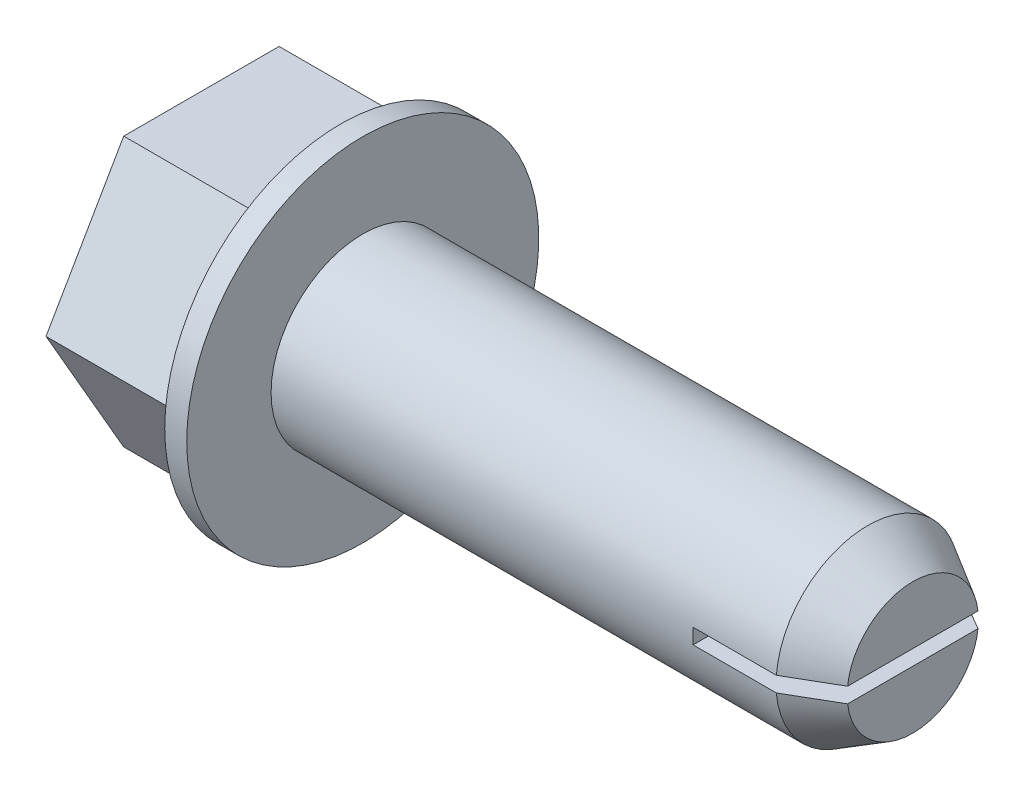
ISO-10303-21;
HEADER;
FILE_DESCRIPTION(('STEP AP214'),'2;1');
FILE_NAME('part.step','',(''),(''),'','','');
FILE_SCHEMA(('AUTOMOTIVE_DESIGN { 1 0 10303 214 1 1 1 1 }'));
ENDSEC;
DATA;
#1=APPLICATION_CONTEXT('core data for automotive mechanical design processes');
#2=APPLICATION_PROTOCOL_DEFINITION('international standard','automotive_design',2000,#1);
#3=PRODUCT_CONTEXT('',#1,'mechanical');
#4=PRODUCT('Part','Part','',(#3));
#5=PRODUCT_RELATED_PRODUCT_CATEGORY('part','',(#4));
#6=PRODUCT_DEFINITION_FORMATION('','',#4);
#7=PRODUCT_DEFINITION_CONTEXT('part definition',#1,'design');
#8=PRODUCT_DEFINITION('design','',#6,#7);
#9=PRODUCT_DEFINITION_SHAPE('','',#8);
#10=(LENGTH_UNIT() NAMED_UNIT(*) SI_UNIT(.MILLI.,.METRE.));
#11=(NAMED_UNIT(*) PLANE_ANGLE_UNIT() SI_UNIT($,.RADIAN.));
#12=(NAMED_UNIT(*) SI_UNIT($,.STERADIAN.) SOLID_ANGLE_UNIT());
#13=UNCERTAINTY_MEASURE_WITH_UNIT(LENGTH_MEASURE(1.E-05),#10,'distance_accuracy_value','');
#14=(GEOMETRIC_REPRESENTATION_CONTEXT(3) GLOBAL_UNCERTAINTY_ASSIGNED_CONTEXT((#13)) GLOBAL_UNIT_ASSIGNED_CONTEXT((#10,
#11,#12)) REPRESENTATION_CONTEXT('',''));
#15=CARTESIAN_POINT('',(0.,0.,0.));
#16=DIRECTION('',(0.,0.,1.));
#17=DIRECTION('',(1.,0.,0.));
#18=AXIS2_PLACEMENT_3D('',#15,#16,#17);
#19=CARTESIAN_POINT('',(17.4882097868151,0.,0.));
#20=DIRECTION('',(-1.,0.,0.));
#21=DIRECTION('',(0.,0.,1.));
#22=AXIS2_PLACEMENT_3D('',#19,#20,#21);
#23=CONICAL_SURFACE('',#22,3.175,0.523598775598292);
#24=CARTESIAN_POINT('',(13.5644644613219,0.264583333333333,-5.43393783266142));
#25=CARTESIAN_POINT('',(14.0871826436278,0.264583333333333,-5.13177479743097));
#26=CARTESIAN_POINT('',(14.6098866976322,0.264583333333333,-4.82958732171453));
#27=CARTESIAN_POINT('',(15.6552095136867,0.264583333333333,-4.22504701620635));
#28=CARTESIAN_POINT('',(16.1778282743568,0.264583333333333,-3.92269418402857));
#29=CARTESIAN_POINT('',(17.2241423772534,0.264583333333333,-3.31700106564912));
#30=CARTESIAN_POINT('',(17.7478373461747,0.264583333333333,-3.01366013407215));
#31=CARTESIAN_POINT('',(18.5330792932285,0.264583333333333,-2.55813812615807));
#32=CARTESIAN_POINT('',(18.794774905413,0.264583333333333,-2.4062132971754));
#33=CARTESIAN_POINT('',(19.3179928265594,0.264583333333333,-2.10206558022107));
#34=CARTESIAN_POINT('',(19.5795151356285,0.264583333333333,-1.94984269243398));
#35=CARTESIAN_POINT('',(19.9713214718428,0.264583333333333,-1.72119162168096));
#36=CARTESIAN_POINT('',(20.1017351693419,0.264583333333333,-1.64498568724022));
#37=CARTESIAN_POINT('',(20.3624339826788,0.264583333333333,-1.49234691242498));
#38=CARTESIAN_POINT('',(20.4927190953951,0.264583333333333,-1.41591406671424));
#39=CARTESIAN_POINT('',(20.7529729191661,0.264583333333333,-1.26275197273211));
#40=CARTESIAN_POINT('',(20.8829418010459,0.264583333333333,-1.18602301477345));
#41=CARTESIAN_POINT('',(21.14251237568,0.264583333333333,-1.03196432965892));
#42=CARTESIAN_POINT('',(21.2721140928904,0.264583333333333,-0.954634643864495));
#43=CARTESIAN_POINT('',(21.4659187118913,0.264583333333333,-0.837750528912931));
#44=CARTESIAN_POINT('',(21.5303977933951,0.264583333333333,-0.798654938496787));
#45=CARTESIAN_POINT('',(21.6590775625645,0.264583333333333,-0.719981892284));
#46=CARTESIAN_POINT('',(21.7232781975706,0.264583333333333,-0.680404350306108));
#47=CARTESIAN_POINT('',(21.8513452286603,0.264583333333333,-0.600412864954114));
#48=CARTESIAN_POINT('',(21.9152106571027,0.264583333333333,-0.559997359060232));
#49=CARTESIAN_POINT('',(22.0103272732384,0.264583333333333,-0.498347656476074));
#50=CARTESIAN_POINT('',(22.0419131277855,0.264583333333333,-0.477630823862634));
#51=CARTESIAN_POINT('',(22.1047544025035,0.264583333333333,-0.435703031053967));
#52=CARTESIAN_POINT('',(22.1360098430145,0.264583333333333,-0.414492101535705));
#53=CARTESIAN_POINT('',(22.1903340018692,0.264583333333333,-0.37667837356804));
#54=CARTESIAN_POINT('',(22.2135134700197,0.264583333333333,-0.360235070512369));
#55=CARTESIAN_POINT('',(22.2594652015796,0.264583333333333,-0.326749250525178));
#56=CARTESIAN_POINT('',(22.2822371615549,0.264583333333333,-0.309706312996171));
#57=CARTESIAN_POINT('',(22.327060694743,0.264583333333333,-0.274797007355579));
#58=CARTESIAN_POINT('',(22.3491137774706,0.264583333333333,-0.256932583966008));
#59=CARTESIAN_POINT('',(22.3920781971358,0.264583333333333,-0.219892857452947));
#60=CARTESIAN_POINT('',(22.4129911568137,0.264583333333333,-0.200719509836215));
#61=CARTESIAN_POINT('',(22.4452340578416,0.264583333333333,-0.167667232199067));
#62=CARTESIAN_POINT('',(22.4572435359932,0.264583333333333,-0.154459018855623));
#63=CARTESIAN_POINT('',(22.479742428192,0.264583333333333,-0.126788829304691));
#64=CARTESIAN_POINT('',(22.4902350299064,0.264583333333333,-0.112329587475477));
#65=CARTESIAN_POINT('',(22.5047631481339,0.264583333333333,-0.0879569053171079));
#66=CARTESIAN_POINT('',(22.5096896477211,0.264583333333333,-0.0785848776158666));
#67=CARTESIAN_POINT('',(22.5181377335612,0.264583333333333,-0.0592246580499537));
#68=CARTESIAN_POINT('',(22.5216621220232,0.264583333333333,-0.0492377417068181));
#69=CARTESIAN_POINT('',(22.526418522633,0.264583333333333,-0.0304037026103416));
#70=CARTESIAN_POINT('',(22.5279260208297,0.264583333333333,-0.0216280028123224));
#71=CARTESIAN_POINT('',(22.5294026767469,0.264583333333333,-0.00394842396421162));
#72=CARTESIAN_POINT('',(22.529372938949,0.264583333333333,0.00495535846215336));
#73=CARTESIAN_POINT('',(22.527783754397,0.264583333333333,0.0226015793310859));
#74=CARTESIAN_POINT('',(22.5262273778035,0.264583333333333,0.0313443057191699));
#75=CARTESIAN_POINT('',(22.521799885777,0.264583333333333,0.0484872271525425));
#76=CARTESIAN_POINT('',(22.5189273250771,0.264583333333333,0.0568870345760276));
#77=CARTESIAN_POINT('',(22.5097392618081,0.264583333333333,0.0791084101084659));
#78=CARTESIAN_POINT('',(22.5024306277301,0.264583333333333,0.0925118789448422));
#79=CARTESIAN_POINT('',(22.4859991306919,0.264583333333333,0.118165386221673));
#80=CARTESIAN_POINT('',(22.4768681425319,0.264583333333333,0.130409883182144));
#81=CARTESIAN_POINT('',(22.4502363411997,0.264583333333333,0.162907775207071));
#82=CARTESIAN_POINT('',(22.4316204301427,0.264583333333333,0.182229711479316));
#83=CARTESIAN_POINT('',(22.3928272705957,0.264583333333333,0.21926143600952));
#84=CARTESIAN_POINT('',(22.3726454888353,0.264583333333333,0.23696619389221));
#85=CARTESIAN_POINT('',(22.331293807366,0.264583333333333,0.271428766852513));
#86=CARTESIAN_POINT('',(22.3101188805033,0.264583333333333,0.288180532250144));
#87=CARTESIAN_POINT('',(22.2672661684661,0.264583333333333,0.320948333636695));
#88=CARTESIAN_POINT('',(22.2455892006051,0.264583333333333,0.336965454114015));
#89=CARTESIAN_POINT('',(22.1807081552448,0.264583333333333,0.383801752180299));
#90=CARTESIAN_POINT('',(22.1370014567618,0.264583333333333,0.413922038870454));
#91=CARTESIAN_POINT('',(22.048896754757,0.264583333333333,0.473137956582079));
#92=CARTESIAN_POINT('',(22.0044985971383,0.264583333333333,0.502233354347341));
#93=CARTESIAN_POINT('',(21.9152410723224,0.264583333333333,0.55980954616495));
#94=CARTESIAN_POINT('',(21.8703812772861,0.264583333333333,0.588289676499199));
#95=CARTESIAN_POINT('',(21.7803932808768,0.264583333333333,0.644823342437673));
#96=CARTESIAN_POINT('',(21.7352650728045,0.264583333333333,0.672876867331631));
#97=CARTESIAN_POINT('',(21.6000529942242,0.264583333333333,0.756326551992342));
#98=CARTESIAN_POINT('',(21.5097027331016,0.264583333333333,0.811290588678406));
#99=CARTESIAN_POINT('',(21.3286744912322,0.264583333333333,0.920566584265846));
#100=CARTESIAN_POINT('',(21.237996704292,0.264583333333333,0.97487886591951));
#101=CARTESIAN_POINT('',(20.9657460397315,0.264583333333333,1.13718911539779));
#102=CARTESIAN_POINT('',(20.7838413218696,0.264583333333333,1.24463004979448));
#103=CARTESIAN_POINT('',(20.4196512860542,0.264583333333333,1.45886639904696));
#104=CARTESIAN_POINT('',(20.2373659641305,0.264583333333333,1.5656618071235));
#105=CARTESIAN_POINT('',(19.872544735206,0.264583333333333,1.77891302602804));
#106=CARTESIAN_POINT('',(19.6900087832199,0.264583333333333,1.88536875994202));
#107=CARTESIAN_POINT('',(19.3248125987412,0.264583333333333,2.09806484028111));
#108=CARTESIAN_POINT('',(19.1421523667771,0.264583333333333,2.20430518761478));
#109=CARTESIAN_POINT('',(18.593482033195,0.264583333333333,2.52315422708799));
#110=CARTESIAN_POINT('',(18.2273529450556,0.264583333333333,2.73555815607347));
#111=CARTESIAN_POINT('',(17.4949677931199,0.264583333333333,3.1600954634988));
#112=CARTESIAN_POINT('',(17.1287117383933,0.264583333333333,3.37222885759761));
#113=CARTESIAN_POINT('',(16.4958030337913,0.264583333333333,3.73863282252731));
#114=CARTESIAN_POINT('',(16.2291708103373,0.264583333333333,3.89293867410942));
#115=CARTESIAN_POINT('',(15.6958693731254,0.264583333333333,4.20149757635999));
#116=CARTESIAN_POINT('',(15.4292001587852,0.264583333333333,4.35575062602182));
#117=CARTESIAN_POINT('',(14.896193932015,0.264583333333333,4.66401108570785));
#118=CARTESIAN_POINT('',(14.6298569504703,0.264583333333333,4.81801854913642));
#119=CARTESIAN_POINT('',(14.0971701645499,0.264583333333333,5.12600013471121));
#120=CARTESIAN_POINT('',(13.8308203604949,0.264583333333333,5.27997425741216));
#121=CARTESIAN_POINT('',(13.5644644613219,0.264583333333333,5.43393783266142));
#122=B_SPLINE_CURVE_WITH_KNOTS('',3,(#24,#25,#26,#27,#28,#29,#30,#31,#32,#33,#34,#35,#36,#37,
#38,#39,#40,#41,#42,#43,#44,#45,#46,#47,#48,#49,#50,#51,#52,#53,#54,#55,#56,#57,#58,#59,#60,#61,
#62,#63,#64,#65,#66,#67,#68,#69,#70,#71,#72,#73,#74,#75,#76,#77,#78,#79,#80,#81,#82,#83,#84,#85,
#86,#87,#88,#89,#90,#91,#92,#93,#94,#95,#96,#97,#98,#99,#100,#101,#102,#103,#104,#105,#106,#107,
#108,#109,#110,#111,#112,#113,#114,#115,#116,#117,#118,#119,#120,#121),.UNSPECIFIED.,.F.,.F.,(4,
2,2,2,2,2,2,2,2,2,2,2,2,2,2,2,2,2,2,2,2,2,2,2,2,2,2,2,2,2,2,2,2,2,2,2,2,2,2,2,2,2,2,2,2,2,2,2,
4),(0.,1.81130646860229,3.622639802236,5.43825212692843,6.34604704982731,7.25384141078979,
7.7069811118876,8.16013155518211,8.61291486136263,9.06566726394993,9.29188280622949,
9.51813941174702,9.74486462234725,9.85818301623115,9.97149439317706,10.0567476343856,
10.1420619154501,10.2271836969868,10.3121809794991,10.3656832581214,10.4190714160232,
10.4507572634153,10.4823794625921,10.5089710788502,10.5355435896841,10.5620627709669,
10.5886111423075,10.6341434787856,10.6798835544699,10.760150872277,10.8406599224638,
10.9216332565146,11.0024829336184,11.1616890535531,11.3209311763972,11.480337273529,
11.6397473660916,11.9570077621073,12.2741039642763,12.9078943665277,13.5416914132333,
14.1756230218318,14.8095519507311,16.0793915609185,17.3491539924864,18.2733440817586,
19.197550905017,20.120526080354,21.0434844930674),.UNSPECIFIED.);
#123=CARTESIAN_POINT('',(17.4882097868151,0.264583333333333,-3.16395648827891));
#124=VERTEX_POINT('',#123);
#125=CARTESIAN_POINT('',(19.05,0.264583333333333,-2.25785042678257));
#126=VERTEX_POINT('',#125);
#127=EDGE_CURVE('E538',#124,#126,#122,.T.);
#128=ORIENTED_EDGE('',*,*,#127,.F.);
#129=CARTESIAN_POINT('',(17.4882097868151,0.,0.));
#130=DIRECTION('',(-1.,0.,0.));
#131=DIRECTION('',(0.,0.,1.));
#132=AXIS2_PLACEMENT_3D('',#129,#130,#131);
#133=CIRCLE('',#132,3.175);
#134=CARTESIAN_POINT('',(17.4882097868151,0.264583333333333,3.16395648827891));
#135=VERTEX_POINT('',#134);
#136=EDGE_CURVE('E218',#135,#124,#133,.T.);
#137=ORIENTED_EDGE('',*,*,#136,.F.);
#138=CARTESIAN_POINT('',(19.05,0.264583333333333,2.25785042678256));
#139=VERTEX_POINT('',#138);
#140=EDGE_CURVE('E541',#139,#135,#122,.T.);
#141=ORIENTED_EDGE('',*,*,#140,.F.);
#142=CARTESIAN_POINT('',(19.05,0.,0.));
#143=DIRECTION('',(-1.,0.,0.));
#144=DIRECTION('',(0.,0.,1.));
#145=AXIS2_PLACEMENT_3D('',#142,#143,#144);
#146=CIRCLE('',#145,2.2733);
#147=EDGE_CURVE('E217',#139,#126,#146,.T.);
#148=ORIENTED_EDGE('',*,*,#147,.T.);
#149=EDGE_LOOP('',(#128,#137,#141,#148));
#150=FACE_BOUND('',#149,.T.);
#151=ADVANCED_FACE('F108',(#150),#23,.T.);
#152=CARTESIAN_POINT('',(19.05,3.175,0.));
#153=DIRECTION('',(-1.,0.,0.));
#154=DIRECTION('',(0.,0.,1.));
#155=AXIS2_PLACEMENT_3D('',#152,#153,#154);
#156=PLANE('',#155);
#157=ORIENTED_EDGE('',*,*,#147,.F.);
#158=DIRECTION('',(0.,0.,-1.));
#159=VECTOR('',#158,1.);
#160=CARTESIAN_POINT('',(19.05,0.264583333333333,0.));
#161=LINE('',#160,#159);
#162=EDGE_CURVE('E204',#139,#126,#161,.T.);
#163=ORIENTED_EDGE('',*,*,#162,.T.);
#164=EDGE_LOOP('',(#157,#163));
#165=FACE_BOUND('',#164,.T.);
#166=ADVANCED_FACE('F327',(#165),#156,.F.);
#167=CARTESIAN_POINT('',(0.,0.,0.));
#168=DIRECTION('',(-1.,0.,0.));
#169=DIRECTION('',(0.,0.,1.));
#170=AXIS2_PLACEMENT_3D('',#167,#168,#169);
#171=CYLINDRICAL_SURFACE('',#170,3.175);
#172=CARTESIAN_POINT('',(0.,0.,0.));
#173=DIRECTION('',(-1.,0.,0.));
#174=DIRECTION('',(0.,0.,1.));
#175=AXIS2_PLACEMENT_3D('',#172,#173,#174);
#176=CIRCLE('',#175,3.175);
#177=CARTESIAN_POINT('',(0.,0.,3.175));
#178=VERTEX_POINT('',#177);
#179=EDGE_CURVE('E205',#178,#178,#176,.T.);
#180=ORIENTED_EDGE('',*,*,#179,.F.);
#181=EDGE_LOOP('',(#180));
#182=FACE_BOUND('',#181,.T.);
#183=CARTESIAN_POINT('',(14.605,0.,0.));
#184=DIRECTION('',(-1.,0.,0.));
#185=DIRECTION('',(0.,0.,1.));
#186=AXIS2_PLACEMENT_3D('',#183,#184,#185);
#187=CIRCLE('',#186,3.175);
#188=CARTESIAN_POINT('',(14.605,-0.264583333333333,3.16395648827891));
#189=VERTEX_POINT('',#188);
#190=CARTESIAN_POINT('',(14.605,0.264583333333333,3.16395648827891));
#191=VERTEX_POINT('',#190);
#192=EDGE_CURVE('E82',#189,#191,#187,.T.);
#193=ORIENTED_EDGE('',*,*,#192,.T.);
#194=DIRECTION('',(-1.,0.,0.));
#195=VECTOR('',#194,1.);
#196=CARTESIAN_POINT('',(0.,0.264583333333333,3.16395648827891));
#197=LINE('',#196,#195);
#198=EDGE_CURVE('E305',#191,#135,#197,.F.);
#199=ORIENTED_EDGE('',*,*,#198,.T.);
#200=ORIENTED_EDGE('',*,*,#136,.T.);
#201=DIRECTION('',(-1.,0.,0.));
#202=VECTOR('',#201,1.);
#203=CARTESIAN_POINT('',(0.,0.264583333333333,-3.16395648827891));
#204=LINE('',#203,#202);
#205=CARTESIAN_POINT('',(14.605,0.264583333333333,-3.16395648827891));
#206=VERTEX_POINT('',#205);
#207=EDGE_CURVE('E293',#124,#206,#204,.T.);
#208=ORIENTED_EDGE('',*,*,#207,.T.);
#209=CARTESIAN_POINT('',(14.605,-0.264583333333333,-3.16395648827891));
#210=VERTEX_POINT('',#209);
#211=EDGE_CURVE('E112',#206,#210,#187,.T.);
#212=ORIENTED_EDGE('',*,*,#211,.T.);
#213=DIRECTION('',(-1.,0.,0.));
#214=VECTOR('',#213,1.);
#215=CARTESIAN_POINT('',(0.,-0.264583333333333,-3.16395648827891));
#216=LINE('',#215,#214);
#217=CARTESIAN_POINT('',(17.4882097868151,-0.264583333333333,-3.16395648827891));
#218=VERTEX_POINT('',#217);
#219=EDGE_CURVE('E213',#210,#218,#216,.F.);
#220=ORIENTED_EDGE('',*,*,#219,.T.);
#221=CARTESIAN_POINT('',(17.4882097868151,-0.264583333333333,3.16395648827891));
#222=VERTEX_POINT('',#221);
#223=EDGE_CURVE('E212',#218,#222,#133,.T.);
#224=ORIENTED_EDGE('',*,*,#223,.T.);
#225=DIRECTION('',(-1.,0.,0.));
#226=VECTOR('',#225,1.);
#227=CARTESIAN_POINT('',(0.,-0.264583333333333,3.16395648827891));
#228=LINE('',#227,#226);
#229=EDGE_CURVE('E544',#222,#189,#228,.T.);
#230=ORIENTED_EDGE('',*,*,#229,.T.);
#231=EDGE_LOOP('',(#193,#199,#200,#208,#212,#220,#224,#230));
#232=FACE_BOUND('',#231,.T.);
#233=ADVANCED_FACE('F292',(#182,#232),#171,.T.);
#234=CARTESIAN_POINT('',(-4.6228,3.72872,0.));
#235=DIRECTION('',(1.,0.,0.));
#236=DIRECTION('',(0.,0.,-1.));
#237=AXIS2_PLACEMENT_3D('',#234,#235,#236);
#238=PLANE('',#237);
#239=CARTESIAN_POINT('',(-4.6228,0.,0.));
#240=DIRECTION('',(-1.,0.,0.));
#241=DIRECTION('',(0.,0.,1.));
#242=AXIS2_PLACEMENT_3D('',#239,#240,#241);
#243=CIRCLE('',#242,3.72872);
#244=CARTESIAN_POINT('',(-4.6228,0.,3.72872));
#245=VERTEX_POINT('',#244);
#246=EDGE_CURVE('E272',#245,#245,#243,.T.);
#247=ORIENTED_EDGE('',*,*,#246,.T.);
#248=EDGE_LOOP('',(#247));
#249=FACE_BOUND('',#248,.T.);
#250=ADVANCED_FACE('F110',(#249),#238,.F.);
#251=CARTESIAN_POINT('',(0.,3.175,0.));
#252=DIRECTION('',(-1.,0.,0.));
#253=DIRECTION('',(0.,0.,1.));
#254=AXIS2_PLACEMENT_3D('',#251,#252,#253);
#255=PLANE('',#254);
#256=CARTESIAN_POINT('',(0.,0.,0.));
#257=DIRECTION('',(-1.,0.,0.));
#258=DIRECTION('',(0.,0.,1.));
#259=AXIS2_PLACEMENT_3D('',#256,#257,#258);
#260=CIRCLE('',#259,6.096);
#261=CARTESIAN_POINT('',(0.,0.,6.096));
#262=VERTEX_POINT('',#261);
#263=EDGE_CURVE('E282',#262,#262,#260,.T.);
#264=ORIENTED_EDGE('',*,*,#263,.F.);
#265=EDGE_LOOP('',(#264));
#266=FACE_BOUND('',#265,.T.);
#267=ORIENTED_EDGE('',*,*,#179,.T.);
#268=EDGE_LOOP('',(#267));
#269=FACE_BOUND('',#268,.T.);
#270=ADVANCED_FACE('F377',(#266,#269),#255,.F.);
#271=CARTESIAN_POINT('',(0.,0.,0.));
#272=DIRECTION('',(-1.,0.,0.));
#273=DIRECTION('',(0.,0.,1.));
#274=AXIS2_PLACEMENT_3D('',#271,#272,#273);
#275=CYLINDRICAL_SURFACE('',#274,6.096);
#276=CARTESIAN_POINT('',(-0.762,0.,0.));
#277=DIRECTION('',(-1.,0.,0.));
#278=DIRECTION('',(0.,0.,1.));
#279=AXIS2_PLACEMENT_3D('',#276,#277,#278);
#280=CIRCLE('',#279,6.096);
#281=CARTESIAN_POINT('',(-0.762,0.,6.096));
#282=VERTEX_POINT('',#281);
#283=EDGE_CURVE('E279',#282,#282,#280,.T.);
#284=ORIENTED_EDGE('',*,*,#283,.F.);
#285=EDGE_LOOP('',(#284));
#286=FACE_BOUND('',#285,.T.);
#287=ORIENTED_EDGE('',*,*,#263,.T.);
#288=EDGE_LOOP('',(#287));
#289=FACE_BOUND('',#288,.T.);
#290=ADVANCED_FACE('F373',(#286,#289),#275,.T.);
#291=CARTESIAN_POINT('',(-0.762,6.096,0.));
#292=DIRECTION('',(1.,0.,0.));
#293=DIRECTION('',(0.,0.,-1.));
#294=AXIS2_PLACEMENT_3D('',#291,#292,#293);
#295=PLANE('',#294);
#296=DIRECTION('',(0.,0.,1.));
#297=VECTOR('',#296,1.);
#298=CARTESIAN_POINT('',(-0.762000000008811,-4.6609,0.));
#299=LINE('',#298,#297);
#300=CARTESIAN_POINT('',(-0.762,-4.6609,-2.69097186966593));
#301=VERTEX_POINT('',#300);
#302=CARTESIAN_POINT('',(-0.762,-4.6609,2.69097186966593));
#303=VERTEX_POINT('',#302);
#304=EDGE_CURVE('E227',#301,#303,#299,.T.);
#305=ORIENTED_EDGE('',*,*,#304,.F.);
#306=DIRECTION('',(0.,-0.866025403784439,0.5));
#307=VECTOR('',#306,1.);
#308=CARTESIAN_POINT('',(-0.762000000008811,-10.7431892055105,0.820639440424721));
#309=LINE('',#308,#307);
#310=CARTESIAN_POINT('',(-0.761999999895124,0.,-5.38194373933185));
#311=VERTEX_POINT('',#310);
#312=EDGE_CURVE('E131',#311,#301,#309,.T.);
#313=ORIENTED_EDGE('',*,*,#312,.F.);
#314=DIRECTION('',(0.,-0.866025403784439,-0.5));
#315=VECTOR('',#314,1.);
#316=CARTESIAN_POINT('',(-0.762000000008811,-6.08228920551051,-8.8935550494225));
#317=LINE('',#316,#315);
#318=CARTESIAN_POINT('',(-0.762,4.6609,-2.69097186966593));
#319=VERTEX_POINT('',#318);
#320=EDGE_CURVE('E261',#319,#311,#317,.T.);
#321=ORIENTED_EDGE('',*,*,#320,.F.);
#322=DIRECTION('',(0.,0.,-1.));
#323=VECTOR('',#322,1.);
#324=CARTESIAN_POINT('',(-0.762000000008811,4.6609,0.));
#325=LINE('',#324,#323);
#326=CARTESIAN_POINT('',(-0.762,4.6609,2.69097186966593));
#327=VERTEX_POINT('',#326);
#328=EDGE_CURVE('E252',#327,#319,#325,.T.);
#329=ORIENTED_EDGE('',*,*,#328,.F.);
#330=DIRECTION('',(0.,0.866025403784439,-0.5));
#331=VECTOR('',#330,1.);
#332=CARTESIAN_POINT('',(-0.762000000008811,-6.08228920551051,8.8935550494225));
#333=LINE('',#332,#331);
#334=CARTESIAN_POINT('',(-0.762,0.,5.38194373933185));
#335=VERTEX_POINT('',#334);
#336=EDGE_CURVE('E243',#335,#327,#333,.T.);
#337=ORIENTED_EDGE('',*,*,#336,.F.);
#338=DIRECTION('',(0.,0.866025403784439,0.5));
#339=VECTOR('',#338,1.);
#340=CARTESIAN_POINT('',(-0.762000000008811,-10.7431892055105,-0.820639440424718));
#341=LINE('',#340,#339);
#342=EDGE_CURVE('E234',#303,#335,#341,.T.);
#343=ORIENTED_EDGE('',*,*,#342,.F.);
#344=EDGE_LOOP('',(#305,#313,#321,#329,#337,#343));
#345=FACE_BOUND('',#344,.T.);
#346=ORIENTED_EDGE('',*,*,#283,.T.);
#347=EDGE_LOOP('',(#346));
#348=FACE_BOUND('',#347,.T.);
#349=ADVANCED_FACE('F369',(#345,#348),#295,.F.);
#350=CARTESIAN_POINT('',(-5.588,4.6609,0.));
#351=DIRECTION('',(1.,0.,0.));
#352=DIRECTION('',(0.,0.,-1.));
#353=AXIS2_PLACEMENT_3D('',#350,#351,#352);
#354=PLANE('',#353);
#355=CARTESIAN_POINT('',(-5.588,0.,0.));
#356=DIRECTION('',(-1.,0.,0.));
#357=DIRECTION('',(0.,0.,1.));
#358=AXIS2_PLACEMENT_3D('',#355,#356,#357);
#359=CIRCLE('',#358,3.72872);
#360=CARTESIAN_POINT('',(-5.588,0.,3.72872));
#361=VERTEX_POINT('',#360);
#362=EDGE_CURVE('E276',#361,#361,#359,.T.);
#363=ORIENTED_EDGE('',*,*,#362,.F.);
#364=EDGE_LOOP('',(#363));
#365=FACE_BOUND('',#364,.T.);
#366=DIRECTION('',(0.,-0.866025403784439,0.5));
#367=VECTOR('',#366,1.);
#368=CARTESIAN_POINT('',(-5.588,-10.7431892055105,0.820639440424721));
#369=LINE('',#368,#367);
#370=CARTESIAN_POINT('',(-5.588,0.,-5.38194373933185));
#371=VERTEX_POINT('',#370);
#372=CARTESIAN_POINT('',(-5.588,-4.6609,-2.69097186966593));
#373=VERTEX_POINT('',#372);
#374=EDGE_CURVE('E267',#371,#373,#369,.T.);
#375=ORIENTED_EDGE('',*,*,#374,.T.);
#376=DIRECTION('',(0.,0.,1.));
#377=VECTOR('',#376,1.);
#378=CARTESIAN_POINT('',(-5.588,-4.6609,0.));
#379=LINE('',#378,#377);
#380=CARTESIAN_POINT('',(-5.588,-4.6609,2.69097186966593));
#381=VERTEX_POINT('',#380);
#382=EDGE_CURVE('E231',#373,#381,#379,.T.);
#383=ORIENTED_EDGE('',*,*,#382,.T.);
#384=DIRECTION('',(0.,0.866025403784439,0.5));
#385=VECTOR('',#384,1.);
#386=CARTESIAN_POINT('',(-5.588,-10.7431892055105,-0.820639440424718));
#387=LINE('',#386,#385);
#388=CARTESIAN_POINT('',(-5.588,0.,5.38194373933185));
#389=VERTEX_POINT('',#388);
#390=EDGE_CURVE('E240',#381,#389,#387,.T.);
#391=ORIENTED_EDGE('',*,*,#390,.T.);
#392=DIRECTION('',(0.,0.866025403784439,-0.5));
#393=VECTOR('',#392,1.);
#394=CARTESIAN_POINT('',(-5.588,-6.08228920551051,8.8935550494225));
#395=LINE('',#394,#393);
#396=CARTESIAN_POINT('',(-5.588,4.6609,2.69097186966592));
#397=VERTEX_POINT('',#396);
#398=EDGE_CURVE('E249',#389,#397,#395,.T.);
#399=ORIENTED_EDGE('',*,*,#398,.T.);
#400=DIRECTION('',(0.,0.,-1.));
#401=VECTOR('',#400,1.);
#402=CARTESIAN_POINT('',(-5.588,4.6609,0.));
#403=LINE('',#402,#401);
#404=CARTESIAN_POINT('',(-5.588,4.6609,-2.69097186966593));
#405=VERTEX_POINT('',#404);
#406=EDGE_CURVE('E258',#397,#405,#403,.T.);
#407=ORIENTED_EDGE('',*,*,#406,.T.);
#408=DIRECTION('',(0.,-0.866025403784439,-0.5));
#409=VECTOR('',#408,1.);
#410=CARTESIAN_POINT('',(-5.588,-6.08228920551051,-8.8935550494225));
#411=LINE('',#410,#409);
#412=EDGE_CURVE('E269',#405,#371,#411,.T.);
#413=ORIENTED_EDGE('',*,*,#412,.T.);
#414=EDGE_LOOP('',(#375,#383,#391,#399,#407,#413));
#415=FACE_BOUND('',#414,.T.);
#416=ADVANCED_FACE('F365',(#365,#415),#354,.F.);
#417=CARTESIAN_POINT('',(0.,0.,0.));
#418=DIRECTION('',(-1.,0.,0.));
#419=DIRECTION('',(0.,0.,1.));
#420=AXIS2_PLACEMENT_3D('',#417,#418,#419);
#421=CYLINDRICAL_SURFACE('',#420,3.72872);
#422=ORIENTED_EDGE('',*,*,#246,.F.);
#423=EDGE_LOOP('',(#422));
#424=FACE_BOUND('',#423,.T.);
#425=ORIENTED_EDGE('',*,*,#362,.T.);
#426=EDGE_LOOP('',(#425));
#427=FACE_BOUND('',#426,.T.);
#428=ADVANCED_FACE('F359',(#424,#427),#421,.F.);
#429=CARTESIAN_POINT('',(500000.,-10.7431892055105,0.820639440424721));
#430=DIRECTION('',(0.,-0.5,-0.866025403784439));
#431=DIRECTION('',(0.,0.866025403784439,-0.5));
#432=AXIS2_PLACEMENT_3D('',#429,#430,#431);
#433=PLANE('',#432);
#434=DIRECTION('',(-1.,0.,0.));
#435=VECTOR('',#434,1.);
#436=CARTESIAN_POINT('',(500000.,0.,-5.38194373933185));
#437=LINE('',#436,#435);
#438=EDGE_CURVE('E266',#311,#371,#437,.T.);
#439=ORIENTED_EDGE('',*,*,#438,.F.);
#440=ORIENTED_EDGE('',*,*,#312,.T.);
#441=DIRECTION('',(-1.,0.,0.));
#442=VECTOR('',#441,1.);
#443=CARTESIAN_POINT('',(500000.,-4.6609,-2.69097186966593));
#444=LINE('',#443,#442);
#445=EDGE_CURVE('E221',#301,#373,#444,.T.);
#446=ORIENTED_EDGE('',*,*,#445,.T.);
#447=ORIENTED_EDGE('',*,*,#374,.F.);
#448=EDGE_LOOP('',(#439,#440,#446,#447));
#449=FACE_BOUND('',#448,.T.);
#450=ADVANCED_FACE('F356',(#449),#433,.T.);
#451=CARTESIAN_POINT('',(500000.,-6.08228920551051,-8.8935550494225));
#452=DIRECTION('',(0.,0.5,-0.866025403784439));
#453=DIRECTION('',(0.,0.866025403784439,0.5));
#454=AXIS2_PLACEMENT_3D('',#451,#452,#453);
#455=PLANE('',#454);
#456=ORIENTED_EDGE('',*,*,#412,.F.);
#457=DIRECTION('',(-1.,0.,0.));
#458=VECTOR('',#457,1.);
#459=CARTESIAN_POINT('',(500000.,4.6609,-2.69097186966593));
#460=LINE('',#459,#458);
#461=EDGE_CURVE('E255',#319,#405,#460,.T.);
#462=ORIENTED_EDGE('',*,*,#461,.F.);
#463=ORIENTED_EDGE('',*,*,#320,.T.);
#464=ORIENTED_EDGE('',*,*,#438,.T.);
#465=EDGE_LOOP('',(#456,#462,#463,#464));
#466=FACE_BOUND('',#465,.T.);
#467=ADVANCED_FACE('F354',(#466),#455,.T.);
#468=CARTESIAN_POINT('',(500000.,4.6609,0.));
#469=DIRECTION('',(0.,1.,0.));
#470=DIRECTION('',(0.,0.,1.));
#471=AXIS2_PLACEMENT_3D('',#468,#469,#470);
#472=PLANE('',#471);
#473=ORIENTED_EDGE('',*,*,#406,.F.);
#474=DIRECTION('',(-1.,0.,0.));
#475=VECTOR('',#474,1.);
#476=CARTESIAN_POINT('',(500000.,4.6609,2.69097186966592));
#477=LINE('',#476,#475);
#478=EDGE_CURVE('E246',#327,#397,#477,.T.);
#479=ORIENTED_EDGE('',*,*,#478,.F.);
#480=ORIENTED_EDGE('',*,*,#328,.T.);
#481=ORIENTED_EDGE('',*,*,#461,.T.);
#482=EDGE_LOOP('',(#473,#479,#480,#481));
#483=FACE_BOUND('',#482,.T.);
#484=ADVANCED_FACE('F350',(#483),#472,.T.);
#485=CARTESIAN_POINT('',(500000.,-6.08228920551051,8.8935550494225));
#486=DIRECTION('',(0.,0.5,0.866025403784439));
#487=DIRECTION('',(0.,-0.866025403784439,0.5));
#488=AXIS2_PLACEMENT_3D('',#485,#486,#487);
#489=PLANE('',#488);
#490=ORIENTED_EDGE('',*,*,#398,.F.);
#491=DIRECTION('',(-1.,0.,0.));
#492=VECTOR('',#491,1.);
#493=CARTESIAN_POINT('',(500000.,0.,5.38194373933185));
#494=LINE('',#493,#492);
#495=EDGE_CURVE('E237',#335,#389,#494,.T.);
#496=ORIENTED_EDGE('',*,*,#495,.F.);
#497=ORIENTED_EDGE('',*,*,#336,.T.);
#498=ORIENTED_EDGE('',*,*,#478,.T.);
#499=EDGE_LOOP('',(#490,#496,#497,#498));
#500=FACE_BOUND('',#499,.T.);
#501=ADVANCED_FACE('F343',(#500),#489,.T.);
#502=CARTESIAN_POINT('',(500000.,-10.7431892055105,-0.820639440424718));
#503=DIRECTION('',(0.,-0.5,0.866025403784439));
#504=DIRECTION('',(0.,-0.866025403784439,-0.5));
#505=AXIS2_PLACEMENT_3D('',#502,#503,#504);
#506=PLANE('',#505);
#507=ORIENTED_EDGE('',*,*,#390,.F.);
#508=DIRECTION('',(-1.,0.,0.));
#509=VECTOR('',#508,1.);
#510=CARTESIAN_POINT('',(500000.,-4.6609,2.69097186966593));
#511=LINE('',#510,#509);
#512=EDGE_CURVE('E228',#303,#381,#511,.T.);
#513=ORIENTED_EDGE('',*,*,#512,.F.);
#514=ORIENTED_EDGE('',*,*,#342,.T.);
#515=ORIENTED_EDGE('',*,*,#495,.T.);
#516=EDGE_LOOP('',(#507,#513,#514,#515));
#517=FACE_BOUND('',#516,.T.);
#518=ADVANCED_FACE('F338',(#517),#506,.T.);
#519=CARTESIAN_POINT('',(500000.,-4.6609,0.));
#520=DIRECTION('',(0.,-1.,0.));
#521=DIRECTION('',(0.,0.,-1.));
#522=AXIS2_PLACEMENT_3D('',#519,#520,#521);
#523=PLANE('',#522);
#524=ORIENTED_EDGE('',*,*,#382,.F.);
#525=ORIENTED_EDGE('',*,*,#445,.F.);
#526=ORIENTED_EDGE('',*,*,#304,.T.);
#527=ORIENTED_EDGE('',*,*,#512,.T.);
#528=EDGE_LOOP('',(#524,#525,#526,#527));
#529=FACE_BOUND('',#528,.T.);
#530=ADVANCED_FACE('F334',(#529),#523,.T.);
#531=CARTESIAN_POINT('',(13.5644644613219,-0.264583333333333,5.43393783266142));
#532=CARTESIAN_POINT('',(14.0871826436278,-0.264583333333333,5.13177479743097));
#533=CARTESIAN_POINT('',(14.6098866976322,-0.264583333333333,4.82958732171453));
#534=CARTESIAN_POINT('',(15.6552095136867,-0.264583333333333,4.22504701620634));
#535=CARTESIAN_POINT('',(16.1778282743568,-0.264583333333333,3.92269418402857));
#536=CARTESIAN_POINT('',(17.2241423772534,-0.264583333333333,3.31700106564912));
#537=CARTESIAN_POINT('',(17.7478373461747,-0.264583333333333,3.01366013407215));
#538=CARTESIAN_POINT('',(18.5330792932285,-0.264583333333333,2.55813812615807));
#539=CARTESIAN_POINT('',(18.794774905413,-0.264583333333333,2.4062132971754));
#540=CARTESIAN_POINT('',(19.3179928265594,-0.264583333333333,2.10206558022107));
#541=CARTESIAN_POINT('',(19.5795151356285,-0.264583333333333,1.94984269243398));
#542=CARTESIAN_POINT('',(19.9713214718428,-0.264583333333333,1.72119162168097));
#543=CARTESIAN_POINT('',(20.1017351693419,-0.264583333333333,1.64498568724022));
#544=CARTESIAN_POINT('',(20.3624339826788,-0.264583333333333,1.49234691242498));
#545=CARTESIAN_POINT('',(20.4927190953951,-0.264583333333333,1.41591406671424));
#546=CARTESIAN_POINT('',(20.7529729191661,-0.264583333333333,1.26275197273211));
#547=CARTESIAN_POINT('',(20.8829418010459,-0.264583333333333,1.18602301477345));
#548=CARTESIAN_POINT('',(21.14251237568,-0.264583333333333,1.03196432965892));
#549=CARTESIAN_POINT('',(21.2721140928904,-0.264583333333333,0.954634643864495));
#550=CARTESIAN_POINT('',(21.4659187118913,-0.264583333333333,0.837750528912931));
#551=CARTESIAN_POINT('',(21.5303977933951,-0.264583333333333,0.798654938496787));
#552=CARTESIAN_POINT('',(21.6590775625645,-0.264583333333333,0.719981892283998));
#553=CARTESIAN_POINT('',(21.7232781975706,-0.264583333333333,0.680404350306105));
#554=CARTESIAN_POINT('',(21.8513452286603,-0.264583333333333,0.60041286495411));
#555=CARTESIAN_POINT('',(21.9152106571027,-0.264583333333333,0.55999735906023));
#556=CARTESIAN_POINT('',(22.0103272732384,-0.264583333333333,0.498347656476073));
#557=CARTESIAN_POINT('',(22.0419131277855,-0.264583333333333,0.477630823862632));
#558=CARTESIAN_POINT('',(22.1047544025035,-0.264583333333333,0.435703031053967));
#559=CARTESIAN_POINT('',(22.1360098430145,-0.264583333333333,0.414492101535704));
#560=CARTESIAN_POINT('',(22.1903340018692,-0.264583333333333,0.37667837356804));
#561=CARTESIAN_POINT('',(22.2135134700197,-0.264583333333333,0.360235070512369));
#562=CARTESIAN_POINT('',(22.2594652015796,-0.264583333333333,0.326749250525178));
#563=CARTESIAN_POINT('',(22.2822371615549,-0.264583333333333,0.30970631299617));
#564=CARTESIAN_POINT('',(22.327060694743,-0.264583333333333,0.274797007355579));
#565=CARTESIAN_POINT('',(22.3491137774706,-0.264583333333333,0.256932583966008));
#566=CARTESIAN_POINT('',(22.3920781971358,-0.264583333333333,0.219892857452947));
#567=CARTESIAN_POINT('',(22.4129911568137,-0.264583333333333,0.200719509836214));
#568=CARTESIAN_POINT('',(22.4452340578416,-0.264583333333333,0.167667232199067));
#569=CARTESIAN_POINT('',(22.4572435359932,-0.264583333333333,0.154459018855623));
#570=CARTESIAN_POINT('',(22.479742428192,-0.264583333333333,0.126788829304691));
#571=CARTESIAN_POINT('',(22.4902350299064,-0.264583333333333,0.112329587475477));
#572=CARTESIAN_POINT('',(22.5047631481339,-0.264583333333333,0.0879569053171077));
#573=CARTESIAN_POINT('',(22.5096896477211,-0.264583333333333,0.0785848776158665));
#574=CARTESIAN_POINT('',(22.5181377335612,-0.264583333333333,0.0592246580499535));
#575=CARTESIAN_POINT('',(22.5216621220232,-0.264583333333333,0.0492377417068179));
#576=CARTESIAN_POINT('',(22.526418522633,-0.264583333333333,0.0304037026103415));
#577=CARTESIAN_POINT('',(22.5279260208297,-0.264583333333333,0.0216280028123223));
#578=CARTESIAN_POINT('',(22.5294026767469,-0.264583333333333,0.0039484239642115));
#579=CARTESIAN_POINT('',(22.529372938949,-0.264583333333333,-0.00495535846215348));
#580=CARTESIAN_POINT('',(22.527783754397,-0.264583333333333,-0.022601579331086));
#581=CARTESIAN_POINT('',(22.5262273778035,-0.264583333333333,-0.03134430571917));
#582=CARTESIAN_POINT('',(22.521799885777,-0.264583333333333,-0.0484872271525425));
#583=CARTESIAN_POINT('',(22.5189273250771,-0.264583333333333,-0.0568870345760277));
#584=CARTESIAN_POINT('',(22.5097392618081,-0.264583333333333,-0.0791084101084659));
#585=CARTESIAN_POINT('',(22.5024306277301,-0.264583333333333,-0.0925118789448423));
#586=CARTESIAN_POINT('',(22.4859991306919,-0.264583333333333,-0.118165386221673));
#587=CARTESIAN_POINT('',(22.4768681425319,-0.264583333333333,-0.130409883182144));
#588=CARTESIAN_POINT('',(22.4502363411997,-0.264583333333333,-0.162907775207072));
#589=CARTESIAN_POINT('',(22.4316204301427,-0.264583333333333,-0.182229711479319));
#590=CARTESIAN_POINT('',(22.3928272705957,-0.264583333333333,-0.219261436009522));
#591=CARTESIAN_POINT('',(22.3726454888353,-0.264583333333333,-0.236966193892211));
#592=CARTESIAN_POINT('',(22.331293807366,-0.264583333333333,-0.271428766852512));
#593=CARTESIAN_POINT('',(22.3101188805033,-0.264583333333333,-0.288180532250143));
#594=CARTESIAN_POINT('',(22.2672661684661,-0.264583333333333,-0.320948333636694));
#595=CARTESIAN_POINT('',(22.2455892006051,-0.264583333333333,-0.336965454114015));
#596=CARTESIAN_POINT('',(22.1807081552448,-0.264583333333333,-0.383801752180299));
#597=CARTESIAN_POINT('',(22.1370014567618,-0.264583333333333,-0.413922038870453));
#598=CARTESIAN_POINT('',(22.048896754757,-0.264583333333333,-0.473137956582078));
#599=CARTESIAN_POINT('',(22.0044985971383,-0.264583333333333,-0.50223335434734));
#600=CARTESIAN_POINT('',(21.9152410723224,-0.264583333333333,-0.55980954616495));
#601=CARTESIAN_POINT('',(21.8703812772861,-0.264583333333333,-0.5882896764992));
#602=CARTESIAN_POINT('',(21.7803932808768,-0.264583333333333,-0.644823342437674));
#603=CARTESIAN_POINT('',(21.7352650728045,-0.264583333333333,-0.672876867331632));
#604=CARTESIAN_POINT('',(21.6000529942242,-0.264583333333333,-0.756326551992344));
#605=CARTESIAN_POINT('',(21.5097027331016,-0.264583333333333,-0.811290588678408));
#606=CARTESIAN_POINT('',(21.3286744912322,-0.264583333333333,-0.92056658426585));
#607=CARTESIAN_POINT('',(21.237996704292,-0.264583333333333,-0.974878865919514));
#608=CARTESIAN_POINT('',(20.9657460397315,-0.264583333333333,-1.13718911539779));
#609=CARTESIAN_POINT('',(20.7838413218696,-0.264583333333333,-1.24463004979449));
#610=CARTESIAN_POINT('',(20.4196512860542,-0.264583333333333,-1.45886639904696));
#611=CARTESIAN_POINT('',(20.2373659641305,-0.264583333333333,-1.56566180712351));
#612=CARTESIAN_POINT('',(19.872544735206,-0.264583333333333,-1.77891302602805));
#613=CARTESIAN_POINT('',(19.6900087832199,-0.264583333333333,-1.88536875994202));
#614=CARTESIAN_POINT('',(19.3248125987411,-0.264583333333333,-2.09806484028111));
#615=CARTESIAN_POINT('',(19.1421523667771,-0.264583333333333,-2.20430518761479));
#616=CARTESIAN_POINT('',(18.593482033195,-0.264583333333333,-2.523154227088));
#617=CARTESIAN_POINT('',(18.2273529450556,-0.264583333333333,-2.73555815607349));
#618=CARTESIAN_POINT('',(17.4949677931198,-0.264583333333333,-3.16009546349881));
#619=CARTESIAN_POINT('',(17.1287117383933,-0.264583333333333,-3.37222885759762));
#620=CARTESIAN_POINT('',(16.4958030337913,-0.264583333333333,-3.73863282252733));
#621=CARTESIAN_POINT('',(16.2291708103372,-0.264583333333333,-3.89293867410943));
#622=CARTESIAN_POINT('',(15.6958693731254,-0.264583333333333,-4.20149757636));
#623=CARTESIAN_POINT('',(15.4292001587852,-0.264583333333333,-4.35575062602183));
#624=CARTESIAN_POINT('',(14.8961939320149,-0.264583333333333,-4.66401108570785));
#625=CARTESIAN_POINT('',(14.6298569504703,-0.264583333333333,-4.81801854913642));
#626=CARTESIAN_POINT('',(14.0971701645499,-0.264583333333333,-5.12600013471121));
#627=CARTESIAN_POINT('',(13.8308203604949,-0.264583333333333,-5.27997425741216));
#628=CARTESIAN_POINT('',(13.5644644613219,-0.264583333333333,-5.43393783266142));
#629=B_SPLINE_CURVE_WITH_KNOTS('',3,(#531,#532,#533,#534,#535,#536,#537,#538,#539,#540,#541,
#542,#543,#544,#545,#546,#547,#548,#549,#550,#551,#552,#553,#554,#555,#556,#557,#558,#559,#560,
#561,#562,#563,#564,#565,#566,#567,#568,#569,#570,#571,#572,#573,#574,#575,#576,#577,#578,#579,
#580,#581,#582,#583,#584,#585,#586,#587,#588,#589,#590,#591,#592,#593,#594,#595,#596,#597,#598,
#599,#600,#601,#602,#603,#604,#605,#606,#607,#608,#609,#610,#611,#612,#613,#614,#615,#616,#617,
#618,#619,#620,#621,#622,#623,#624,#625,#626,#627,#628),.UNSPECIFIED.,.F.,.F.,(4,2,2,2,2,2,2,2,
2,2,2,2,2,2,2,2,2,2,2,2,2,2,2,2,2,2,2,2,2,2,2,2,2,2,2,2,2,2,2,2,2,2,2,2,2,2,2,2,4),(0.,
1.8113064686023,3.62263980223601,5.43825212692844,6.34604704982731,7.25384141078979,
7.7069811118876,8.16013155518211,8.61291486136263,9.06566726394994,9.2918828062295,
9.51813941174703,9.74486462234726,9.85818301623116,9.97149439317707,10.0567476343856,
10.1420619154501,10.2271836969868,10.3121809794991,10.3656832581214,10.4190714160232,
10.4507572634153,10.4823794625922,10.5089710788502,10.5355435896841,10.5620627709669,
10.5886111423075,10.6341434787857,10.6798835544699,10.760150872277,10.8406599224638,
10.9216332565146,11.0024829336184,11.1616890535531,11.3209311763972,11.480337273529,
11.6397473660916,11.9570077621073,12.2741039642763,12.9078943665277,13.5416914132333,
14.1756230218318,14.8095519507312,16.0793915609185,17.3491539924864,18.2733440817586,
19.197550905017,20.120526080354,21.0434844930674),.UNSPECIFIED.);
#630=CARTESIAN_POINT('',(19.05,-0.264583333333333,2.25785042678257));
#631=VERTEX_POINT('',#630);
#632=EDGE_CURVE('E123',#222,#631,#629,.T.);
#633=ORIENTED_EDGE('',*,*,#632,.F.);
#634=ORIENTED_EDGE('',*,*,#223,.F.);
#635=CARTESIAN_POINT('',(19.05,-0.264583333333333,-2.25785042678257));
#636=VERTEX_POINT('',#635);
#637=EDGE_CURVE('E199',#636,#218,#629,.T.);
#638=ORIENTED_EDGE('',*,*,#637,.F.);
#639=EDGE_CURVE('E210',#636,#631,#146,.T.);
#640=ORIENTED_EDGE('',*,*,#639,.T.);
#641=EDGE_LOOP('',(#633,#634,#638,#640));
#642=FACE_BOUND('',#641,.T.);
#643=ADVANCED_FACE('F209',(#642),#23,.T.);
#644=ORIENTED_EDGE('',*,*,#639,.F.);
#645=DIRECTION('',(0.,0.,1.));
#646=VECTOR('',#645,1.);
#647=CARTESIAN_POINT('',(19.05,-0.264583333333333,0.));
#648=LINE('',#647,#646);
#649=EDGE_CURVE('E196',#636,#631,#648,.T.);
#650=ORIENTED_EDGE('',*,*,#649,.T.);
#651=EDGE_LOOP('',(#644,#650));
#652=FACE_BOUND('',#651,.T.);
#653=ADVANCED_FACE('F216',(#652),#156,.F.);
#654=CARTESIAN_POINT('',(14.605,0.264583333333333,-6.096));
#655=DIRECTION('',(-1.,0.,0.));
#656=DIRECTION('',(0.,0.,1.));
#657=AXIS2_PLACEMENT_3D('',#654,#655,#656);
#658=PLANE('',#657);
#659=DIRECTION('',(0.,0.,1.));
#660=VECTOR('',#659,1.);
#661=CARTESIAN_POINT('',(14.605,0.264583333333333,-6.096));
#662=LINE('',#661,#660);
#663=EDGE_CURVE('E214',#206,#191,#662,.T.);
#664=ORIENTED_EDGE('',*,*,#663,.T.);
#665=ORIENTED_EDGE('',*,*,#192,.F.);
#666=DIRECTION('',(0.,0.,1.));
#667=VECTOR('',#666,1.);
#668=CARTESIAN_POINT('',(14.605,-0.264583333333333,-6.096));
#669=LINE('',#668,#667);
#670=EDGE_CURVE('E300',#210,#189,#669,.T.);
#671=ORIENTED_EDGE('',*,*,#670,.F.);
#672=ORIENTED_EDGE('',*,*,#211,.F.);
#673=EDGE_LOOP('',(#664,#665,#671,#672));
#674=FACE_BOUND('',#673,.T.);
#675=ADVANCED_FACE('F298',(#674),#658,.F.);
#676=CARTESIAN_POINT('',(14.605,0.264583333333333,-6.096));
#677=DIRECTION('',(0.,1.,0.));
#678=DIRECTION('',(0.,0.,1.));
#679=AXIS2_PLACEMENT_3D('',#676,#677,#678);
#680=PLANE('',#679);
#681=ORIENTED_EDGE('',*,*,#127,.T.);
#682=ORIENTED_EDGE('',*,*,#162,.F.);
#683=ORIENTED_EDGE('',*,*,#140,.T.);
#684=ORIENTED_EDGE('',*,*,#198,.F.);
#685=ORIENTED_EDGE('',*,*,#663,.F.);
#686=ORIENTED_EDGE('',*,*,#207,.F.);
#687=EDGE_LOOP('',(#681,#682,#683,#684,#685,#686));
#688=FACE_BOUND('',#687,.T.);
#689=ADVANCED_FACE('F302',(#688),#680,.F.);
#690=CARTESIAN_POINT('',(14.605,-0.264583333333333,-6.096));
#691=DIRECTION('',(0.,-1.,0.));
#692=DIRECTION('',(0.,0.,-1.));
#693=AXIS2_PLACEMENT_3D('',#690,#691,#692);
#694=PLANE('',#693);
#695=ORIENTED_EDGE('',*,*,#632,.T.);
#696=ORIENTED_EDGE('',*,*,#649,.F.);
#697=ORIENTED_EDGE('',*,*,#637,.T.);
#698=ORIENTED_EDGE('',*,*,#219,.F.);
#699=ORIENTED_EDGE('',*,*,#670,.T.);
#700=ORIENTED_EDGE('',*,*,#229,.F.);
#701=EDGE_LOOP('',(#695,#696,#697,#698,#699,#700));
#702=FACE_BOUND('',#701,.T.);
#703=ADVANCED_FACE('F198',(#702),#694,.F.);
#704=CLOSED_SHELL('',(#151,#166,#233,#250,#270,#290,#349,#416,#428,#450,#467,#484,#501,#518,
#530,#643,#653,#675,#689,#703));
#705=MANIFOLD_SOLID_BREP('B7',#704);
#706=ADVANCED_BREP_SHAPE_REPRESENTATION('',(#18,#705),#14);
#707=SHAPE_DEFINITION_REPRESENTATION(#9,#706);
ENDSEC;
END-ISO-10303-21;
